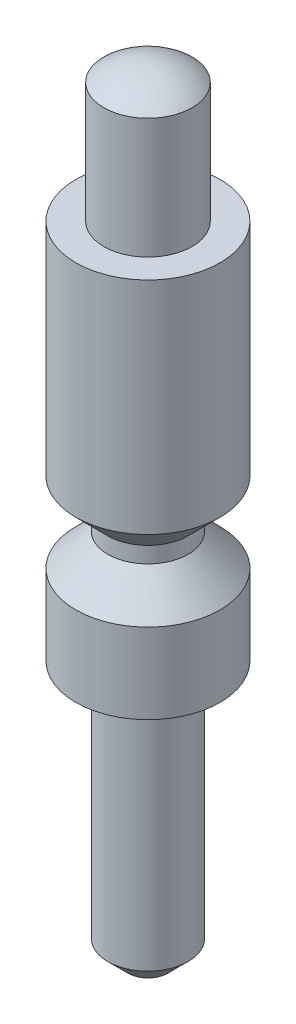
ISO-10303-21;
HEADER;
FILE_DESCRIPTION(('STEP AP214'),'2;1');
FILE_NAME('part.step','',(''),(''),'','','');
FILE_SCHEMA(('AUTOMOTIVE_DESIGN { 1 0 10303 214 1 1 1 1 }'));
ENDSEC;
DATA;
#1=APPLICATION_CONTEXT('core data for automotive mechanical design processes');
#2=APPLICATION_PROTOCOL_DEFINITION('international standard','automotive_design',2000,#1);
#3=PRODUCT_CONTEXT('',#1,'mechanical');
#4=PRODUCT('Part','Part','',(#3));
#5=PRODUCT_RELATED_PRODUCT_CATEGORY('part','',(#4));
#6=PRODUCT_DEFINITION_FORMATION('','',#4);
#7=PRODUCT_DEFINITION_CONTEXT('part definition',#1,'design');
#8=PRODUCT_DEFINITION('design','',#6,#7);
#9=PRODUCT_DEFINITION_SHAPE('','',#8);
#10=(LENGTH_UNIT() NAMED_UNIT(*) SI_UNIT(.MILLI.,.METRE.));
#11=(NAMED_UNIT(*) PLANE_ANGLE_UNIT() SI_UNIT($,.RADIAN.));
#12=(NAMED_UNIT(*) SI_UNIT($,.STERADIAN.) SOLID_ANGLE_UNIT());
#13=UNCERTAINTY_MEASURE_WITH_UNIT(LENGTH_MEASURE(1.E-05),#10,'distance_accuracy_value','');
#14=(GEOMETRIC_REPRESENTATION_CONTEXT(3) GLOBAL_UNCERTAINTY_ASSIGNED_CONTEXT((#13)) GLOBAL_UNIT_ASSIGNED_CONTEXT((#10,
#11,#12)) REPRESENTATION_CONTEXT('',''));
#15=CARTESIAN_POINT('',(0.,0.,0.));
#16=DIRECTION('',(0.,0.,1.));
#17=DIRECTION('',(1.,0.,0.));
#18=AXIS2_PLACEMENT_3D('',#15,#16,#17);
#19=CARTESIAN_POINT('',(-28.92728245926,-5.552019390202,-14.93448402181));
#20=DIRECTION('',(0.,-1.,0.));
#21=DIRECTION('',(0.,0.,-1.));
#22=AXIS2_PLACEMENT_3D('',#19,#20,#21);
#23=PLANE('',#22);
#24=CARTESIAN_POINT('',(-29.17728245926,-5.5520193901657,-14.93448402181));
#25=DIRECTION('',(0.,1.,0.));
#26=DIRECTION('',(0.,0.,1.));
#27=AXIS2_PLACEMENT_3D('',#24,#25,#26);
#28=CIRCLE('',#27,0.249999999996342);
#29=CARTESIAN_POINT('',(-29.17728245926,-5.5520193901657,-14.6844840218137));
#30=VERTEX_POINT('',#29);
#31=EDGE_CURVE('E18',#30,#30,#28,.T.);
#32=ORIENTED_EDGE('',*,*,#31,.F.);
#33=EDGE_LOOP('',(#32));
#34=FACE_BOUND('',#33,.T.);
#35=ADVANCED_FACE('F15',(#34),#23,.T.);
#36=CARTESIAN_POINT('',(-29.17728245926,-5.30201939011476,-14.93448402181));
#37=DIRECTION('',(0.,1.,0.));
#38=DIRECTION('',(0.,0.,1.));
#39=AXIS2_PLACEMENT_3D('',#36,#37,#38);
#40=CONICAL_SURFACE('',#39,0.500000000104117,0.785398163511135);
#41=ORIENTED_EDGE('',*,*,#31,.T.);
#42=EDGE_LOOP('',(#41));
#43=FACE_BOUND('',#42,.T.);
#44=CARTESIAN_POINT('',(-29.17728245926,-5.302019390202,-14.93448402181));
#45=DIRECTION('',(0.,1.,0.));
#46=DIRECTION('',(0.,0.,1.));
#47=AXIS2_PLACEMENT_3D('',#44,#45,#46);
#48=CIRCLE('',#47,0.5);
#49=CARTESIAN_POINT('',(-29.17728245926,-5.302019390202,-14.43448402181));
#50=VERTEX_POINT('',#49);
#51=EDGE_CURVE('E35',#50,#50,#48,.T.);
#52=ORIENTED_EDGE('',*,*,#51,.F.);
#53=EDGE_LOOP('',(#52));
#54=FACE_BOUND('',#53,.T.);
#55=ADVANCED_FACE('F55',(#43,#54),#40,.T.);
#56=CARTESIAN_POINT('',(-29.17728245926,2.447980609798,-14.93448402181));
#57=DIRECTION('',(0.,1.,0.));
#58=DIRECTION('',(0.,0.,1.));
#59=AXIS2_PLACEMENT_3D('',#56,#57,#58);
#60=CYLINDRICAL_SURFACE('',#59,0.5);
#61=CARTESIAN_POINT('',(-29.17728245926,-2.302019390202,-14.93448402181));
#62=DIRECTION('',(0.,1.,0.));
#63=DIRECTION('',(0.,0.,1.));
#64=AXIS2_PLACEMENT_3D('',#61,#62,#63);
#65=CIRCLE('',#64,0.5);
#66=CARTESIAN_POINT('',(-29.17728245926,-2.302019390202,-14.43448402181));
#67=VERTEX_POINT('',#66);
#68=EDGE_CURVE('E106',#67,#67,#65,.T.);
#69=ORIENTED_EDGE('',*,*,#68,.F.);
#70=EDGE_LOOP('',(#69));
#71=FACE_BOUND('',#70,.T.);
#72=ORIENTED_EDGE('',*,*,#51,.T.);
#73=EDGE_LOOP('',(#72));
#74=FACE_BOUND('',#73,.T.);
#75=ADVANCED_FACE('F52',(#71,#74),#60,.T.);
#76=CARTESIAN_POINT('',(-28.27728245926,-2.302019390202,-14.93448402181));
#77=DIRECTION('',(0.,-1.,0.));
#78=DIRECTION('',(0.,0.,-1.));
#79=AXIS2_PLACEMENT_3D('',#76,#77,#78);
#80=PLANE('',#79);
#81=ORIENTED_EDGE('',*,*,#68,.T.);
#82=EDGE_LOOP('',(#81));
#83=FACE_BOUND('',#82,.T.);
#84=CARTESIAN_POINT('',(-29.17728245926,-2.302019390202,-14.93448402181));
#85=DIRECTION('',(0.,1.,0.));
#86=DIRECTION('',(0.,0.,1.));
#87=AXIS2_PLACEMENT_3D('',#84,#85,#86);
#88=CIRCLE('',#87,0.9);
#89=CARTESIAN_POINT('',(-29.17728245926,-2.302019390202,-14.03448402181));
#90=VERTEX_POINT('',#89);
#91=EDGE_CURVE('E104',#90,#90,#88,.T.);
#92=ORIENTED_EDGE('',*,*,#91,.F.);
#93=EDGE_LOOP('',(#92));
#94=FACE_BOUND('',#93,.T.);
#95=ADVANCED_FACE('F48',(#83,#94),#80,.T.);
#96=CARTESIAN_POINT('',(-29.17728245926,2.447980609798,-14.93448402181));
#97=DIRECTION('',(0.,1.,0.));
#98=DIRECTION('',(0.,0.,1.));
#99=AXIS2_PLACEMENT_3D('',#96,#97,#98);
#100=CYLINDRICAL_SURFACE('',#99,0.9);
#101=CARTESIAN_POINT('',(-29.17728245926,-1.30201939015251,-14.93448402181));
#102=DIRECTION('',(0.,-1.,0.));
#103=DIRECTION('',(0.,0.,-1.));
#104=AXIS2_PLACEMENT_3D('',#101,#102,#103);
#105=CIRCLE('',#104,0.899999999999202);
#106=CARTESIAN_POINT('',(-29.17728245926,-1.30201939015251,-15.8344840218092));
#107=VERTEX_POINT('',#106);
#108=EDGE_CURVE('E103',#107,#107,#105,.F.);
#109=ORIENTED_EDGE('',*,*,#108,.F.);
#110=EDGE_LOOP('',(#109));
#111=FACE_BOUND('',#110,.T.);
#112=ORIENTED_EDGE('',*,*,#91,.T.);
#113=EDGE_LOOP('',(#112));
#114=FACE_BOUND('',#113,.T.);
#115=ADVANCED_FACE('F43',(#111,#114),#100,.T.);
#116=CARTESIAN_POINT('',(-29.17728245926,3.291730609798,-14.93448402181));
#117=DIRECTION('',(1.,0.,0.));
#118=DIRECTION('',(0.,1.,0.));
#119=AXIS2_PLACEMENT_3D('',#116,#117,#118);
#120=SPHERICAL_SURFACE('',#119,0.85625);
#121=CARTESIAN_POINT('',(-29.17728245926,3.947980609798,-14.93448402181));
#122=DIRECTION('',(0.,1.,0.));
#123=DIRECTION('',(0.,0.,1.));
#124=AXIS2_PLACEMENT_3D('',#121,#122,#123);
#125=CIRCLE('',#124,0.55);
#126=CARTESIAN_POINT('',(-29.17728245926,3.947980609798,-14.38448402181));
#127=VERTEX_POINT('',#126);
#128=EDGE_CURVE('E94',#127,#127,#125,.F.);
#129=ORIENTED_EDGE('',*,*,#128,.F.);
#130=EDGE_LOOP('',(#129));
#131=FACE_BOUND('',#130,.T.);
#132=ADVANCED_FACE('F38',(#131),#120,.T.);
#133=CARTESIAN_POINT('',(-29.17728245926,-1.30201939009567,-14.93448402181));
#134=DIRECTION('',(0.,-1.,0.));
#135=DIRECTION('',(0.,0.,-1.));
#136=AXIS2_PLACEMENT_3D('',#133,#134,#135);
#137=CONICAL_SURFACE('',#136,0.899999999885515,0.785398163326394);
#138=CARTESIAN_POINT('',(-29.17728245926,-0.902019390202,-14.93448402181));
#139=DIRECTION('',(0.,1.,0.));
#140=DIRECTION('',(0.,0.,1.));
#141=AXIS2_PLACEMENT_3D('',#138,#139,#140);
#142=CIRCLE('',#141,0.5);
#143=CARTESIAN_POINT('',(-29.17728245926,-0.902019390202,-14.43448402181));
#144=VERTEX_POINT('',#143);
#145=EDGE_CURVE('E97',#144,#144,#142,.T.);
#146=ORIENTED_EDGE('',*,*,#145,.F.);
#147=EDGE_LOOP('',(#146));
#148=FACE_BOUND('',#147,.T.);
#149=ORIENTED_EDGE('',*,*,#108,.T.);
#150=EDGE_LOOP('',(#149));
#151=FACE_BOUND('',#150,.T.);
#152=ADVANCED_FACE('F42',(#148,#151),#137,.T.);
#153=CARTESIAN_POINT('',(-29.17728245926,2.447980609798,-14.93448402181));
#154=DIRECTION('',(0.,1.,0.));
#155=DIRECTION('',(0.,0.,1.));
#156=AXIS2_PLACEMENT_3D('',#153,#154,#155);
#157=CYLINDRICAL_SURFACE('',#156,0.55);
#158=ORIENTED_EDGE('',*,*,#128,.T.);
#159=EDGE_LOOP('',(#158));
#160=FACE_BOUND('',#159,.T.);
#161=CARTESIAN_POINT('',(-29.17728245926,2.447980609798,-14.93448402181));
#162=DIRECTION('',(0.,1.,0.));
#163=DIRECTION('',(0.,0.,1.));
#164=AXIS2_PLACEMENT_3D('',#161,#162,#163);
#165=CIRCLE('',#164,0.55);
#166=CARTESIAN_POINT('',(-29.17728245926,2.447980609798,-14.38448402181));
#167=VERTEX_POINT('',#166);
#168=EDGE_CURVE('E32',#167,#167,#165,.F.);
#169=ORIENTED_EDGE('',*,*,#168,.F.);
#170=EDGE_LOOP('',(#169));
#171=FACE_BOUND('',#170,.T.);
#172=ADVANCED_FACE('F83',(#160,#171),#157,.T.);
#173=CARTESIAN_POINT('',(-29.17728245926,2.447980609798,-14.93448402181));
#174=DIRECTION('',(0.,1.,0.));
#175=DIRECTION('',(0.,0.,1.));
#176=AXIS2_PLACEMENT_3D('',#173,#174,#175);
#177=CYLINDRICAL_SURFACE('',#176,0.5);
#178=ORIENTED_EDGE('',*,*,#145,.T.);
#179=EDGE_LOOP('',(#178));
#180=FACE_BOUND('',#179,.T.);
#181=CARTESIAN_POINT('',(-29.17728245926,-0.702019390189434,-14.93448402181));
#182=DIRECTION('',(0.,1.,0.));
#183=DIRECTION('',(0.,0.,1.));
#184=AXIS2_PLACEMENT_3D('',#181,#182,#183);
#185=CIRCLE('',#184,0.49999999999043);
#186=CARTESIAN_POINT('',(-29.17728245926,-0.702019390189434,-14.4344840218196));
#187=VERTEX_POINT('',#186);
#188=EDGE_CURVE('E27',#187,#187,#185,.T.);
#189=ORIENTED_EDGE('',*,*,#188,.F.);
#190=EDGE_LOOP('',(#189));
#191=FACE_BOUND('',#190,.T.);
#192=ADVANCED_FACE('F80',(#180,#191),#177,.T.);
#193=CARTESIAN_POINT('',(-28.62728245926,2.447980609798,-14.93448402181));
#194=DIRECTION('',(0.,1.,0.));
#195=DIRECTION('',(0.,0.,1.));
#196=AXIS2_PLACEMENT_3D('',#193,#194,#195);
#197=PLANE('',#196);
#198=ORIENTED_EDGE('',*,*,#168,.T.);
#199=EDGE_LOOP('',(#198));
#200=FACE_BOUND('',#199,.T.);
#201=CARTESIAN_POINT('',(-29.17728245926,2.447980609798,-14.93448402181));
#202=DIRECTION('',(0.,1.,0.));
#203=DIRECTION('',(0.,0.,1.));
#204=AXIS2_PLACEMENT_3D('',#201,#202,#203);
#205=CIRCLE('',#204,0.9);
#206=CARTESIAN_POINT('',(-29.17728245926,2.447980609798,-14.03448402181));
#207=VERTEX_POINT('',#206);
#208=EDGE_CURVE('E22',#207,#207,#205,.F.);
#209=ORIENTED_EDGE('',*,*,#208,.F.);
#210=EDGE_LOOP('',(#209));
#211=FACE_BOUND('',#210,.T.);
#212=ADVANCED_FACE('F73',(#200,#211),#197,.T.);
#213=CARTESIAN_POINT('',(-29.17728245926,-0.302019390232999,-14.93448402181));
#214=DIRECTION('',(0.,1.,0.));
#215=DIRECTION('',(0.,0.,1.));
#216=AXIS2_PLACEMENT_3D('',#213,#214,#215);
#217=CONICAL_SURFACE('',#216,0.899999999946865,0.785398163397448);
#218=CARTESIAN_POINT('',(-29.17728245926,-0.302019390202,-14.93448402181));
#219=DIRECTION('',(0.,1.,0.));
#220=DIRECTION('',(0.,0.,1.));
#221=AXIS2_PLACEMENT_3D('',#218,#219,#220);
#222=CIRCLE('',#221,0.9);
#223=CARTESIAN_POINT('',(-29.17728245926,-0.302019390202,-14.03448402181));
#224=VERTEX_POINT('',#223);
#225=EDGE_CURVE('E10',#224,#224,#222,.T.);
#226=ORIENTED_EDGE('',*,*,#225,.F.);
#227=EDGE_LOOP('',(#226));
#228=FACE_BOUND('',#227,.T.);
#229=ORIENTED_EDGE('',*,*,#188,.T.);
#230=EDGE_LOOP('',(#229));
#231=FACE_BOUND('',#230,.T.);
#232=ADVANCED_FACE('F68',(#228,#231),#217,.T.);
#233=CARTESIAN_POINT('',(-29.17728245926,2.447980609798,-14.93448402181));
#234=DIRECTION('',(0.,1.,0.));
#235=DIRECTION('',(0.,0.,1.));
#236=AXIS2_PLACEMENT_3D('',#233,#234,#235);
#237=CYLINDRICAL_SURFACE('',#236,0.9);
#238=ORIENTED_EDGE('',*,*,#225,.T.);
#239=EDGE_LOOP('',(#238));
#240=FACE_BOUND('',#239,.T.);
#241=ORIENTED_EDGE('',*,*,#208,.T.);
#242=EDGE_LOOP('',(#241));
#243=FACE_BOUND('',#242,.T.);
#244=ADVANCED_FACE('F66',(#240,#243),#237,.T.);
#245=CLOSED_SHELL('',(#35,#55,#75,#95,#115,#132,#152,#172,#192,#212,#232,#244));
#246=MANIFOLD_SOLID_BREP('B1',#245);
#247=ADVANCED_BREP_SHAPE_REPRESENTATION('',(#18,#246),#14);
#248=SHAPE_DEFINITION_REPRESENTATION(#9,#247);
ENDSEC;
END-ISO-10303-21;
